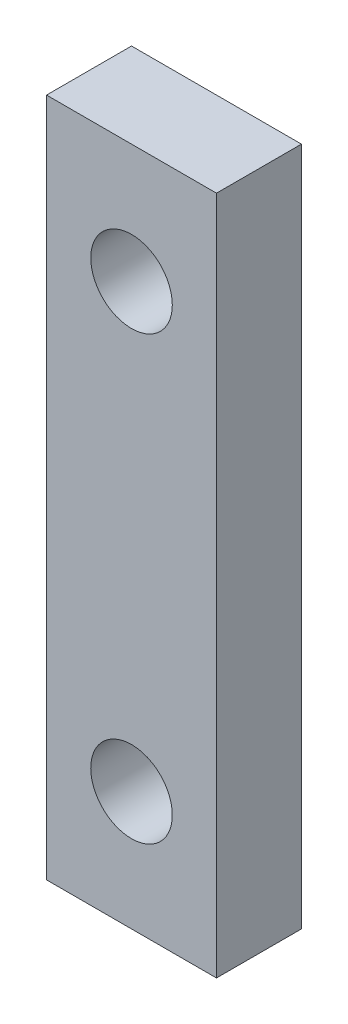
ISO-10303-21;
HEADER;
FILE_DESCRIPTION(('STEP AP214'),'2;1');
FILE_NAME('part.step','',(''),(''),'','','');
FILE_SCHEMA(('AUTOMOTIVE_DESIGN { 1 0 10303 214 1 1 1 1 }'));
ENDSEC;
DATA;
#1=APPLICATION_CONTEXT('core data for automotive mechanical design processes');
#2=APPLICATION_PROTOCOL_DEFINITION('international standard','automotive_design',2000,#1);
#3=PRODUCT_CONTEXT('',#1,'mechanical');
#4=PRODUCT('Part','Part','',(#3));
#5=PRODUCT_RELATED_PRODUCT_CATEGORY('part','',(#4));
#6=PRODUCT_DEFINITION_FORMATION('','',#4);
#7=PRODUCT_DEFINITION_CONTEXT('part definition',#1,'design');
#8=PRODUCT_DEFINITION('design','',#6,#7);
#9=PRODUCT_DEFINITION_SHAPE('','',#8);
#10=(LENGTH_UNIT() NAMED_UNIT(*) SI_UNIT(.MILLI.,.METRE.));
#11=(NAMED_UNIT(*) PLANE_ANGLE_UNIT() SI_UNIT($,.RADIAN.));
#12=(NAMED_UNIT(*) SI_UNIT($,.STERADIAN.) SOLID_ANGLE_UNIT());
#13=UNCERTAINTY_MEASURE_WITH_UNIT(LENGTH_MEASURE(1.E-05),#10,'distance_accuracy_value','');
#14=(GEOMETRIC_REPRESENTATION_CONTEXT(3) GLOBAL_UNCERTAINTY_ASSIGNED_CONTEXT((#13)) GLOBAL_UNIT_ASSIGNED_CONTEXT((#10,
#11,#12)) REPRESENTATION_CONTEXT('',''));
#15=CARTESIAN_POINT('',(0.,0.,0.));
#16=DIRECTION('',(0.,0.,1.));
#17=DIRECTION('',(1.,0.,0.));
#18=AXIS2_PLACEMENT_3D('',#15,#16,#17);
#19=CARTESIAN_POINT('',(0.,0.,5.));
#20=DIRECTION('',(0.,0.,1.));
#21=DIRECTION('',(1.,0.,0.));
#22=AXIS2_PLACEMENT_3D('',#19,#20,#21);
#23=PLANE('',#22);
#24=CARTESIAN_POINT('',(0.,13.,5.));
#25=DIRECTION('',(0.,0.,1.));
#26=DIRECTION('',(1.,0.,0.));
#27=AXIS2_PLACEMENT_3D('',#24,#25,#26);
#28=CIRCLE('',#27,2.4);
#29=CARTESIAN_POINT('',(2.4,13.,5.));
#30=VERTEX_POINT('',#29);
#31=EDGE_CURVE('E100',#30,#30,#28,.T.);
#32=ORIENTED_EDGE('',*,*,#31,.F.);
#33=EDGE_LOOP('',(#32));
#34=FACE_BOUND('',#33,.T.);
#35=DIRECTION('',(0.,1.,0.));
#36=VECTOR('',#35,1.);
#37=CARTESIAN_POINT('',(5.,20.,5.));
#38=LINE('',#37,#36);
#39=CARTESIAN_POINT('',(5.,-20.,5.));
#40=VERTEX_POINT('',#39);
#41=CARTESIAN_POINT('',(5.,20.,5.));
#42=VERTEX_POINT('',#41);
#43=EDGE_CURVE('E85',#40,#42,#38,.T.);
#44=ORIENTED_EDGE('',*,*,#43,.T.);
#45=DIRECTION('',(-1.,0.,0.));
#46=VECTOR('',#45,1.);
#47=CARTESIAN_POINT('',(-5.,20.,5.));
#48=LINE('',#47,#46);
#49=CARTESIAN_POINT('',(-5.,20.,5.));
#50=VERTEX_POINT('',#49);
#51=EDGE_CURVE('E80',#42,#50,#48,.T.);
#52=ORIENTED_EDGE('',*,*,#51,.T.);
#53=DIRECTION('',(0.,-1.,0.));
#54=VECTOR('',#53,1.);
#55=CARTESIAN_POINT('',(-5.,20.,5.));
#56=LINE('',#55,#54);
#57=CARTESIAN_POINT('',(-5.,-20.,5.));
#58=VERTEX_POINT('',#57);
#59=EDGE_CURVE('E83',#50,#58,#56,.T.);
#60=ORIENTED_EDGE('',*,*,#59,.T.);
#61=DIRECTION('',(1.,0.,0.));
#62=VECTOR('',#61,1.);
#63=CARTESIAN_POINT('',(-5.,-20.,5.));
#64=LINE('',#63,#62);
#65=EDGE_CURVE('E50',#58,#40,#64,.T.);
#66=ORIENTED_EDGE('',*,*,#65,.T.);
#67=EDGE_LOOP('',(#44,#52,#60,#66));
#68=FACE_BOUND('',#67,.T.);
#69=CARTESIAN_POINT('',(0.,-13.,5.));
#70=DIRECTION('',(0.,0.,1.));
#71=DIRECTION('',(-1.,0.,0.));
#72=AXIS2_PLACEMENT_3D('',#69,#70,#71);
#73=CIRCLE('',#72,2.4);
#74=CARTESIAN_POINT('',(-2.4,-13.,5.));
#75=VERTEX_POINT('',#74);
#76=EDGE_CURVE('E115',#75,#75,#73,.T.);
#77=ORIENTED_EDGE('',*,*,#76,.F.);
#78=EDGE_LOOP('',(#77));
#79=FACE_BOUND('',#78,.T.);
#80=ADVANCED_FACE('F33',(#34,#68,#79),#23,.T.);
#81=CARTESIAN_POINT('',(0.,0.,0.));
#82=DIRECTION('',(0.,0.,1.));
#83=DIRECTION('',(1.,0.,0.));
#84=AXIS2_PLACEMENT_3D('',#81,#82,#83);
#85=PLANE('',#84);
#86=DIRECTION('',(0.,1.,0.));
#87=VECTOR('',#86,1.);
#88=CARTESIAN_POINT('',(5.,20.,0.));
#89=LINE('',#88,#87);
#90=CARTESIAN_POINT('',(5.,-20.,0.));
#91=VERTEX_POINT('',#90);
#92=CARTESIAN_POINT('',(5.,20.,0.));
#93=VERTEX_POINT('',#92);
#94=EDGE_CURVE('E97',#91,#93,#89,.T.);
#95=ORIENTED_EDGE('',*,*,#94,.F.);
#96=DIRECTION('',(1.,0.,0.));
#97=VECTOR('',#96,1.);
#98=CARTESIAN_POINT('',(-5.,-20.,0.));
#99=LINE('',#98,#97);
#100=CARTESIAN_POINT('',(-5.,-20.,0.));
#101=VERTEX_POINT('',#100);
#102=EDGE_CURVE('E73',#101,#91,#99,.T.);
#103=ORIENTED_EDGE('',*,*,#102,.F.);
#104=DIRECTION('',(0.,-1.,0.));
#105=VECTOR('',#104,1.);
#106=CARTESIAN_POINT('',(-5.,20.,0.));
#107=LINE('',#106,#105);
#108=CARTESIAN_POINT('',(-5.,20.,0.));
#109=VERTEX_POINT('',#108);
#110=EDGE_CURVE('E67',#109,#101,#107,.T.);
#111=ORIENTED_EDGE('',*,*,#110,.F.);
#112=DIRECTION('',(-1.,0.,0.));
#113=VECTOR('',#112,1.);
#114=CARTESIAN_POINT('',(-5.,20.,0.));
#115=LINE('',#114,#113);
#116=EDGE_CURVE('E89',#93,#109,#115,.T.);
#117=ORIENTED_EDGE('',*,*,#116,.F.);
#118=EDGE_LOOP('',(#95,#103,#111,#117));
#119=FACE_BOUND('',#118,.T.);
#120=CARTESIAN_POINT('',(0.,13.,0.));
#121=DIRECTION('',(0.,0.,1.));
#122=DIRECTION('',(1.,0.,0.));
#123=AXIS2_PLACEMENT_3D('',#120,#121,#122);
#124=CIRCLE('',#123,2.4);
#125=CARTESIAN_POINT('',(2.4,13.,0.));
#126=VERTEX_POINT('',#125);
#127=EDGE_CURVE('E112',#126,#126,#124,.T.);
#128=ORIENTED_EDGE('',*,*,#127,.T.);
#129=EDGE_LOOP('',(#128));
#130=FACE_BOUND('',#129,.T.);
#131=CARTESIAN_POINT('',(0.,-13.,0.));
#132=DIRECTION('',(0.,0.,1.));
#133=DIRECTION('',(-1.,0.,0.));
#134=AXIS2_PLACEMENT_3D('',#131,#132,#133);
#135=CIRCLE('',#134,2.4);
#136=CARTESIAN_POINT('',(-2.4,-13.,0.));
#137=VERTEX_POINT('',#136);
#138=EDGE_CURVE('E118',#137,#137,#135,.T.);
#139=ORIENTED_EDGE('',*,*,#138,.T.);
#140=EDGE_LOOP('',(#139));
#141=FACE_BOUND('',#140,.T.);
#142=ADVANCED_FACE('F108',(#119,#130,#141),#85,.F.);
#143=CARTESIAN_POINT('',(5.,20.,5.));
#144=DIRECTION('',(-1.,0.,0.));
#145=DIRECTION('',(0.,0.,1.));
#146=AXIS2_PLACEMENT_3D('',#143,#144,#145);
#147=PLANE('',#146);
#148=ORIENTED_EDGE('',*,*,#94,.T.);
#149=DIRECTION('',(0.,0.,-1.));
#150=VECTOR('',#149,1.);
#151=CARTESIAN_POINT('',(5.,20.,5.));
#152=LINE('',#151,#150);
#153=EDGE_CURVE('E11',#42,#93,#152,.T.);
#154=ORIENTED_EDGE('',*,*,#153,.F.);
#155=ORIENTED_EDGE('',*,*,#43,.F.);
#156=DIRECTION('',(0.,0.,-1.));
#157=VECTOR('',#156,1.);
#158=CARTESIAN_POINT('',(5.,-20.,5.));
#159=LINE('',#158,#157);
#160=EDGE_CURVE('E93',#40,#91,#159,.T.);
#161=ORIENTED_EDGE('',*,*,#160,.T.);
#162=EDGE_LOOP('',(#148,#154,#155,#161));
#163=FACE_BOUND('',#162,.T.);
#164=ADVANCED_FACE('F35',(#163),#147,.F.);
#165=CARTESIAN_POINT('',(-5.,20.,5.));
#166=DIRECTION('',(0.,-1.,0.));
#167=DIRECTION('',(0.,0.,-1.));
#168=AXIS2_PLACEMENT_3D('',#165,#166,#167);
#169=PLANE('',#168);
#170=ORIENTED_EDGE('',*,*,#116,.T.);
#171=DIRECTION('',(0.,0.,-1.));
#172=VECTOR('',#171,1.);
#173=CARTESIAN_POINT('',(-5.,20.,5.));
#174=LINE('',#173,#172);
#175=EDGE_CURVE('E42',#50,#109,#174,.T.);
#176=ORIENTED_EDGE('',*,*,#175,.F.);
#177=ORIENTED_EDGE('',*,*,#51,.F.);
#178=ORIENTED_EDGE('',*,*,#153,.T.);
#179=EDGE_LOOP('',(#170,#176,#177,#178));
#180=FACE_BOUND('',#179,.T.);
#181=ADVANCED_FACE('F88',(#180),#169,.F.);
#182=CARTESIAN_POINT('',(-5.,20.,5.));
#183=DIRECTION('',(1.,0.,0.));
#184=DIRECTION('',(0.,0.,-1.));
#185=AXIS2_PLACEMENT_3D('',#182,#183,#184);
#186=PLANE('',#185);
#187=ORIENTED_EDGE('',*,*,#110,.T.);
#188=DIRECTION('',(0.,0.,-1.));
#189=VECTOR('',#188,1.);
#190=CARTESIAN_POINT('',(-5.,-20.,5.));
#191=LINE('',#190,#189);
#192=EDGE_CURVE('E90',#58,#101,#191,.T.);
#193=ORIENTED_EDGE('',*,*,#192,.F.);
#194=ORIENTED_EDGE('',*,*,#59,.F.);
#195=ORIENTED_EDGE('',*,*,#175,.T.);
#196=EDGE_LOOP('',(#187,#193,#194,#195));
#197=FACE_BOUND('',#196,.T.);
#198=ADVANCED_FACE('F91',(#197),#186,.F.);
#199=CARTESIAN_POINT('',(-5.,-20.,5.));
#200=DIRECTION('',(0.,1.,0.));
#201=DIRECTION('',(0.,0.,1.));
#202=AXIS2_PLACEMENT_3D('',#199,#200,#201);
#203=PLANE('',#202);
#204=ORIENTED_EDGE('',*,*,#102,.T.);
#205=ORIENTED_EDGE('',*,*,#160,.F.);
#206=ORIENTED_EDGE('',*,*,#65,.F.);
#207=ORIENTED_EDGE('',*,*,#192,.T.);
#208=EDGE_LOOP('',(#204,#205,#206,#207));
#209=FACE_BOUND('',#208,.T.);
#210=ADVANCED_FACE('F105',(#209),#203,.F.);
#211=CARTESIAN_POINT('',(0.,13.,5.));
#212=DIRECTION('',(0.,0.,-1.));
#213=DIRECTION('',(-1.,0.,0.));
#214=AXIS2_PLACEMENT_3D('',#211,#212,#213);
#215=CYLINDRICAL_SURFACE('',#214,2.4);
#216=ORIENTED_EDGE('',*,*,#31,.T.);
#217=EDGE_LOOP('',(#216));
#218=FACE_BOUND('',#217,.T.);
#219=ORIENTED_EDGE('',*,*,#127,.F.);
#220=EDGE_LOOP('',(#219));
#221=FACE_BOUND('',#220,.T.);
#222=ADVANCED_FACE('F135',(#218,#221),#215,.F.);
#223=CARTESIAN_POINT('',(0.,-13.,5.));
#224=DIRECTION('',(0.,0.,-1.));
#225=DIRECTION('',(-1.,0.,0.));
#226=AXIS2_PLACEMENT_3D('',#223,#224,#225);
#227=CYLINDRICAL_SURFACE('',#226,2.4);
#228=ORIENTED_EDGE('',*,*,#76,.T.);
#229=EDGE_LOOP('',(#228));
#230=FACE_BOUND('',#229,.T.);
#231=ORIENTED_EDGE('',*,*,#138,.F.);
#232=EDGE_LOOP('',(#231));
#233=FACE_BOUND('',#232,.T.);
#234=ADVANCED_FACE('F124',(#230,#233),#227,.F.);
#235=CLOSED_SHELL('',(#80,#142,#164,#181,#198,#210,#222,#234));
#236=MANIFOLD_SOLID_BREP('B2',#235);
#237=ADVANCED_BREP_SHAPE_REPRESENTATION('',(#18,#236),#14);
#238=SHAPE_DEFINITION_REPRESENTATION(#9,#237);
ENDSEC;
END-ISO-10303-21;
